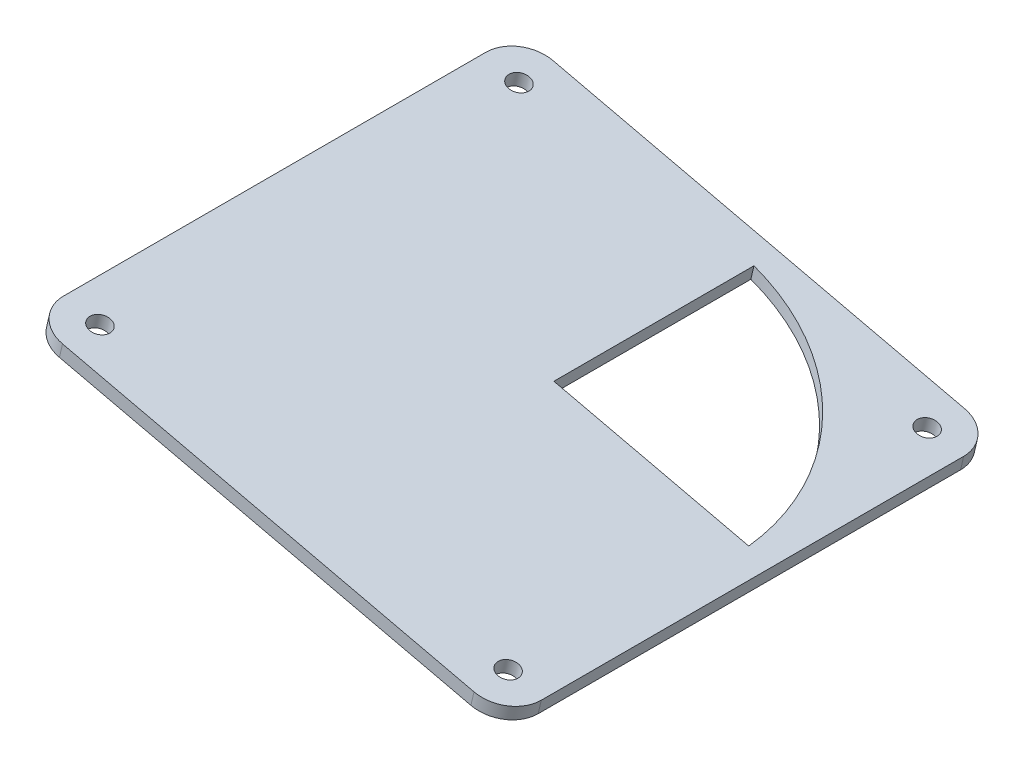
ISO-10303-21;
HEADER;
FILE_DESCRIPTION(('STEP AP214'),'2;1');
FILE_NAME('part.step','',(''),(''),'','','');
FILE_SCHEMA(('AUTOMOTIVE_DESIGN { 1 0 10303 214 1 1 1 1 }'));
ENDSEC;
DATA;
#1=APPLICATION_CONTEXT('core data for automotive mechanical design processes');
#2=APPLICATION_PROTOCOL_DEFINITION('international standard','automotive_design',2000,#1);
#3=PRODUCT_CONTEXT('',#1,'mechanical');
#4=PRODUCT('Part','Part','',(#3));
#5=PRODUCT_RELATED_PRODUCT_CATEGORY('part','',(#4));
#6=PRODUCT_DEFINITION_FORMATION('','',#4);
#7=PRODUCT_DEFINITION_CONTEXT('part definition',#1,'design');
#8=PRODUCT_DEFINITION('design','',#6,#7);
#9=PRODUCT_DEFINITION_SHAPE('','',#8);
#10=(LENGTH_UNIT() NAMED_UNIT(*) SI_UNIT(.MILLI.,.METRE.));
#11=(NAMED_UNIT(*) PLANE_ANGLE_UNIT() SI_UNIT($,.RADIAN.));
#12=(NAMED_UNIT(*) SI_UNIT($,.STERADIAN.) SOLID_ANGLE_UNIT());
#13=UNCERTAINTY_MEASURE_WITH_UNIT(LENGTH_MEASURE(1.E-05),#10,'distance_accuracy_value','');
#14=(GEOMETRIC_REPRESENTATION_CONTEXT(3) GLOBAL_UNCERTAINTY_ASSIGNED_CONTEXT((#13)) GLOBAL_UNIT_ASSIGNED_CONTEXT((#10,
#11,#12)) REPRESENTATION_CONTEXT('',''));
#15=CARTESIAN_POINT('',(0.,0.,0.));
#16=DIRECTION('',(0.,0.,1.));
#17=DIRECTION('',(1.,0.,0.));
#18=AXIS2_PLACEMENT_3D('',#15,#16,#17);
#19=CARTESIAN_POINT('',(-50.3621157465799,72.3277479247575,65.2764415124017));
#20=DIRECTION('',(-0.226273724263932,-0.974063756490164,0.));
#21=DIRECTION('',(0.974063756490165,-0.226273724263932,0.));
#22=AXIS2_PLACEMENT_3D('',#19,#20,#21);
#23=PLANE('',#22);
#24=CARTESIAN_POINT('',(-50.3621157465799,72.3277479247575,65.2764415124017));
#25=DIRECTION('',(0.226273724263932,0.974063756490164,0.));
#26=DIRECTION('',(0.974063756490165,-0.226273724263932,0.));
#27=AXIS2_PLACEMENT_3D('',#24,#25,#26);
#28=CIRCLE('',#27,5.);
#29=CARTESIAN_POINT('',(-55.2324345290308,73.4591165460771,65.2764415124017));
#30=VERTEX_POINT('',#29);
#31=CARTESIAN_POINT('',(-50.3621157465799,72.3277479247575,70.2764415124017));
#32=VERTEX_POINT('',#31);
#33=EDGE_CURVE('E170',#30,#32,#28,.T.);
#34=ORIENTED_EDGE('',*,*,#33,.T.);
#35=DIRECTION('',(0.974063756490164,-0.226273724263932,0.));
#36=VECTOR('',#35,1.);
#37=CARTESIAN_POINT('',(-50.3621157465799,72.3277479247575,70.2764415124017));
#38=LINE('',#37,#36);
#39=CARTESIAN_POINT('',(10.0298371558103,58.2987770203937,70.2764415124017));
#40=VERTEX_POINT('',#39);
#41=EDGE_CURVE('E173',#32,#40,#38,.T.);
#42=ORIENTED_EDGE('',*,*,#41,.T.);
#43=CARTESIAN_POINT('',(10.0298371558103,58.2987770203937,65.2764415124017));
#44=DIRECTION('',(0.226273724263932,0.974063756490164,0.));
#45=DIRECTION('',(-0.974063756490165,0.226273724263932,0.));
#46=AXIS2_PLACEMENT_3D('',#43,#44,#45);
#47=CIRCLE('',#46,5.);
#48=CARTESIAN_POINT('',(14.9001559382611,57.167408399074,65.2764415124017));
#49=VERTEX_POINT('',#48);
#50=EDGE_CURVE('E176',#40,#49,#47,.T.);
#51=ORIENTED_EDGE('',*,*,#50,.T.);
#52=DIRECTION('',(0.,0.,-1.));
#53=VECTOR('',#52,1.);
#54=CARTESIAN_POINT('',(14.9001559382611,57.167408399074,65.2764415124017));
#55=LINE('',#54,#53);
#56=CARTESIAN_POINT('',(14.9001559382611,57.167408399074,3.27644151240175));
#57=VERTEX_POINT('',#56);
#58=EDGE_CURVE('E178',#49,#57,#55,.T.);
#59=ORIENTED_EDGE('',*,*,#58,.T.);
#60=CARTESIAN_POINT('',(10.0298371558103,58.2987770203937,3.27644151240175));
#61=DIRECTION('',(0.226273724263932,0.974063756490164,0.));
#62=DIRECTION('',(0.974063756490165,-0.226273724263932,0.));
#63=AXIS2_PLACEMENT_3D('',#60,#61,#62);
#64=CIRCLE('',#63,5.);
#65=CARTESIAN_POINT('',(10.0298371558103,58.2987770203937,-1.72355848759825));
#66=VERTEX_POINT('',#65);
#67=EDGE_CURVE('E180',#57,#66,#64,.T.);
#68=ORIENTED_EDGE('',*,*,#67,.T.);
#69=DIRECTION('',(-0.974063756490164,0.226273724263932,0.));
#70=VECTOR('',#69,1.);
#71=CARTESIAN_POINT('',(-50.3621157465799,72.3277479247575,-1.72355848759825));
#72=LINE('',#71,#70);
#73=CARTESIAN_POINT('',(-50.3621157465799,72.3277479247575,-1.72355848759825));
#74=VERTEX_POINT('',#73);
#75=EDGE_CURVE('E182',#66,#74,#72,.T.);
#76=ORIENTED_EDGE('',*,*,#75,.T.);
#77=CARTESIAN_POINT('',(-50.3621157465799,72.3277479247575,3.27644151240175));
#78=DIRECTION('',(0.226273724263932,0.974063756490164,0.));
#79=DIRECTION('',(0.974063756490165,-0.226273724263932,0.));
#80=AXIS2_PLACEMENT_3D('',#77,#78,#79);
#81=CIRCLE('',#80,5.);
#82=CARTESIAN_POINT('',(-55.2324345290308,73.4591165460771,3.27644151240175));
#83=VERTEX_POINT('',#82);
#84=EDGE_CURVE('E184',#74,#83,#81,.T.);
#85=ORIENTED_EDGE('',*,*,#84,.T.);
#86=DIRECTION('',(0.,0.,1.));
#87=VECTOR('',#86,1.);
#88=CARTESIAN_POINT('',(-55.2324345290308,73.4591165460771,65.2764415124017));
#89=LINE('',#88,#87);
#90=EDGE_CURVE('E186',#83,#30,#89,.T.);
#91=ORIENTED_EDGE('',*,*,#90,.T.);
#92=EDGE_LOOP('',(#34,#42,#51,#59,#68,#76,#85,#91));
#93=FACE_BOUND('',#92,.T.);
#94=CARTESIAN_POINT('',(-50.1185998074574,72.2711794936915,3.52644151240175));
#95=DIRECTION('',(0.226273724263932,0.974063756490164,0.));
#96=DIRECTION('',(-0.974063756490165,0.226273724263932,0.));
#97=AXIS2_PLACEMENT_3D('',#94,#95,#96);
#98=CIRCLE('',#97,1.5);
#99=CARTESIAN_POINT('',(-51.5796954421927,72.6105900800874,3.52644151240175));
#100=VERTEX_POINT('',#99);
#101=EDGE_CURVE('E164',#100,#100,#98,.T.);
#102=ORIENTED_EDGE('',*,*,#101,.F.);
#103=EDGE_LOOP('',(#102));
#104=FACE_BOUND('',#103,.T.);
#105=CARTESIAN_POINT('',(-50.1185998074574,72.2711794936915,65.0264415124017));
#106=DIRECTION('',(0.226273724263932,0.974063756490164,0.));
#107=DIRECTION('',(-0.974063756490165,0.226273724263932,0.));
#108=AXIS2_PLACEMENT_3D('',#105,#106,#107);
#109=CIRCLE('',#108,1.5);
#110=CARTESIAN_POINT('',(-51.5796954421927,72.6105900800874,65.0264415124017));
#111=VERTEX_POINT('',#110);
#112=EDGE_CURVE('E158',#111,#111,#109,.T.);
#113=ORIENTED_EDGE('',*,*,#112,.F.);
#114=EDGE_LOOP('',(#113));
#115=FACE_BOUND('',#114,.T.);
#116=CARTESIAN_POINT('',(9.78632121668771,58.3553454514597,65.0264415124017));
#117=DIRECTION('',(0.226273724263932,0.974063756490164,0.));
#118=DIRECTION('',(-0.974063756490165,0.226273724263932,0.));
#119=AXIS2_PLACEMENT_3D('',#116,#117,#118);
#120=CIRCLE('',#119,1.5);
#121=CARTESIAN_POINT('',(8.32522558195246,58.6947560378556,65.0264415124017));
#122=VERTEX_POINT('',#121);
#123=EDGE_CURVE('E152',#122,#122,#120,.T.);
#124=ORIENTED_EDGE('',*,*,#123,.F.);
#125=EDGE_LOOP('',(#124));
#126=FACE_BOUND('',#125,.T.);
#127=CARTESIAN_POINT('',(9.78632121668769,58.3553454514597,3.52644151240175));
#128=DIRECTION('',(0.226273724263932,0.974063756490164,0.));
#129=DIRECTION('',(-0.974063756490165,0.226273724263932,0.));
#130=AXIS2_PLACEMENT_3D('',#127,#128,#129);
#131=CIRCLE('',#130,1.5);
#132=CARTESIAN_POINT('',(8.32522558195245,58.6947560378556,3.52644151240175));
#133=VERTEX_POINT('',#132);
#134=EDGE_CURVE('E146',#133,#133,#131,.T.);
#135=ORIENTED_EDGE('',*,*,#134,.F.);
#136=EDGE_LOOP('',(#135));
#137=FACE_BOUND('',#136,.T.);
#138=CARTESIAN_POINT('',(-20.1661392953848,65.3132624725756,34.2764415124018));
#139=DIRECTION('',(0.226273724263932,0.974063756490164,0.));
#140=DIRECTION('',(-0.974063756490165,0.226273724263932,0.));
#141=AXIS2_PLACEMENT_3D('',#138,#139,#140);
#142=CIRCLE('',#141,32.5);
#143=CARTESIAN_POINT('',(11.3557738958925,57.9907636667321,31.2764415124017));
#144=VERTEX_POINT('',#143);
#145=CARTESIAN_POINT('',(-17.2439480259143,64.6344412997838,1.91519926183294));
#146=VERTEX_POINT('',#145);
#147=EDGE_CURVE('E142',#144,#146,#142,.T.);
#148=ORIENTED_EDGE('',*,*,#147,.F.);
#149=DIRECTION('',(0.974063756490164,-0.226273724263932,0.));
#150=VECTOR('',#149,1.);
#151=CARTESIAN_POINT('',(13.3628695619654,57.5245179941154,31.2764415124017));
#152=LINE('',#151,#150);
#153=CARTESIAN_POINT('',(-17.2439480259143,64.6344412997838,31.2764415124017));
#154=VERTEX_POINT('',#153);
#155=EDGE_CURVE('E138',#154,#144,#152,.T.);
#156=ORIENTED_EDGE('',*,*,#155,.F.);
#157=DIRECTION('',(0.,0.,-1.));
#158=VECTOR('',#157,1.);
#159=CARTESIAN_POINT('',(-17.2439480259143,64.6344412997838,0.));
#160=LINE('',#159,#158);
#161=EDGE_CURVE('E123',#154,#146,#160,.T.);
#162=ORIENTED_EDGE('',*,*,#161,.T.);
#163=EDGE_LOOP('',(#148,#156,#162));
#164=FACE_BOUND('',#163,.T.);
#165=ADVANCED_FACE('F35',(#93,#104,#115,#126,#137,#164),#23,.F.);
#166=CARTESIAN_POINT('',(-50.8146631951078,70.3796204117771,65.2764415124017));
#167=DIRECTION('',(-0.226273724263932,-0.974063756490164,0.));
#168=DIRECTION('',(0.974063756490165,-0.226273724263932,0.));
#169=AXIS2_PLACEMENT_3D('',#166,#167,#168);
#170=PLANE('',#169);
#171=CARTESIAN_POINT('',(9.33377376815983,56.4072179384793,3.52644151240175));
#172=DIRECTION('',(0.226273724263932,0.974063756490164,0.));
#173=DIRECTION('',(-0.974063756490165,0.226273724263932,0.));
#174=AXIS2_PLACEMENT_3D('',#171,#172,#173);
#175=CIRCLE('',#174,1.5);
#176=CARTESIAN_POINT('',(7.87267813342458,56.7466285248752,3.52644151240175));
#177=VERTEX_POINT('',#176);
#178=EDGE_CURVE('E144',#177,#177,#175,.T.);
#179=ORIENTED_EDGE('',*,*,#178,.T.);
#180=EDGE_LOOP('',(#179));
#181=FACE_BOUND('',#180,.T.);
#182=CARTESIAN_POINT('',(-50.5711472559853,70.3230519807111,65.0264415124017));
#183=DIRECTION('',(0.226273724263932,0.974063756490164,0.));
#184=DIRECTION('',(-0.974063756490165,0.226273724263932,0.));
#185=AXIS2_PLACEMENT_3D('',#182,#183,#184);
#186=CIRCLE('',#185,1.5);
#187=CARTESIAN_POINT('',(-52.0322428907205,70.6624625671071,65.0264415124017));
#188=VERTEX_POINT('',#187);
#189=EDGE_CURVE('E155',#188,#188,#186,.T.);
#190=ORIENTED_EDGE('',*,*,#189,.T.);
#191=EDGE_LOOP('',(#190));
#192=FACE_BOUND('',#191,.T.);
#193=CARTESIAN_POINT('',(-50.8146631951078,70.3796204117771,65.2764415124017));
#194=DIRECTION('',(0.226273724263932,0.974063756490164,0.));
#195=DIRECTION('',(0.974063756490165,-0.226273724263932,0.));
#196=AXIS2_PLACEMENT_3D('',#193,#194,#195);
#197=CIRCLE('',#196,5.);
#198=CARTESIAN_POINT('',(-55.6849819775586,71.5109890330968,65.2764415124017));
#199=VERTEX_POINT('',#198);
#200=CARTESIAN_POINT('',(-50.8146631951078,70.3796204117771,70.2764415124017));
#201=VERTEX_POINT('',#200);
#202=EDGE_CURVE('E167',#199,#201,#197,.T.);
#203=ORIENTED_EDGE('',*,*,#202,.F.);
#204=DIRECTION('',(0.,0.,1.));
#205=VECTOR('',#204,1.);
#206=CARTESIAN_POINT('',(-55.6849819775586,71.5109890330968,65.2764415124017));
#207=LINE('',#206,#205);
#208=CARTESIAN_POINT('',(-55.6849819775586,71.5109890330968,3.27644151240175));
#209=VERTEX_POINT('',#208);
#210=EDGE_CURVE('E174',#209,#199,#207,.T.);
#211=ORIENTED_EDGE('',*,*,#210,.F.);
#212=CARTESIAN_POINT('',(-50.8146631951078,70.3796204117771,3.27644151240175));
#213=DIRECTION('',(0.226273724263932,0.974063756490164,0.));
#214=DIRECTION('',(0.974063756490165,-0.226273724263932,0.));
#215=AXIS2_PLACEMENT_3D('',#212,#213,#214);
#216=CIRCLE('',#215,5.);
#217=CARTESIAN_POINT('',(-50.8146631951078,70.3796204117771,-1.72355848759825));
#218=VERTEX_POINT('',#217);
#219=EDGE_CURVE('E201',#218,#209,#216,.T.);
#220=ORIENTED_EDGE('',*,*,#219,.F.);
#221=DIRECTION('',(-0.974063756490164,0.226273724263932,0.));
#222=VECTOR('',#221,1.);
#223=CARTESIAN_POINT('',(-50.8146631951078,70.3796204117771,-1.72355848759825));
#224=LINE('',#223,#222);
#225=CARTESIAN_POINT('',(9.57728970728239,56.3506495074134,-1.72355848759825));
#226=VERTEX_POINT('',#225);
#227=EDGE_CURVE('E199',#226,#218,#224,.T.);
#228=ORIENTED_EDGE('',*,*,#227,.F.);
#229=CARTESIAN_POINT('',(9.57728970728239,56.3506495074134,3.27644151240175));
#230=DIRECTION('',(0.226273724263932,0.974063756490164,0.));
#231=DIRECTION('',(0.974063756490165,-0.226273724263932,0.));
#232=AXIS2_PLACEMENT_3D('',#229,#230,#231);
#233=CIRCLE('',#232,5.);
#234=CARTESIAN_POINT('',(14.4476084897332,55.2192808860937,3.27644151240175));
#235=VERTEX_POINT('',#234);
#236=EDGE_CURVE('E197',#235,#226,#233,.T.);
#237=ORIENTED_EDGE('',*,*,#236,.F.);
#238=DIRECTION('',(0.,0.,-1.));
#239=VECTOR('',#238,1.);
#240=CARTESIAN_POINT('',(14.4476084897332,55.2192808860937,65.2764415124017));
#241=LINE('',#240,#239);
#242=CARTESIAN_POINT('',(14.4476084897332,55.2192808860937,65.2764415124017));
#243=VERTEX_POINT('',#242);
#244=EDGE_CURVE('E195',#243,#235,#241,.T.);
#245=ORIENTED_EDGE('',*,*,#244,.F.);
#246=CARTESIAN_POINT('',(9.57728970728239,56.3506495074134,65.2764415124017));
#247=DIRECTION('',(0.226273724263932,0.974063756490164,0.));
#248=DIRECTION('',(-0.974063756490165,0.226273724263932,0.));
#249=AXIS2_PLACEMENT_3D('',#246,#247,#248);
#250=CIRCLE('',#249,5.);
#251=CARTESIAN_POINT('',(9.57728970728239,56.3506495074134,70.2764415124017));
#252=VERTEX_POINT('',#251);
#253=EDGE_CURVE('E193',#252,#243,#250,.T.);
#254=ORIENTED_EDGE('',*,*,#253,.F.);
#255=DIRECTION('',(0.974063756490164,-0.226273724263932,0.));
#256=VECTOR('',#255,1.);
#257=CARTESIAN_POINT('',(-50.8146631951078,70.3796204117771,70.2764415124017));
#258=LINE('',#257,#256);
#259=EDGE_CURVE('E191',#201,#252,#258,.T.);
#260=ORIENTED_EDGE('',*,*,#259,.F.);
#261=EDGE_LOOP('',(#203,#211,#220,#228,#237,#245,#254,#260));
#262=FACE_BOUND('',#261,.T.);
#263=CARTESIAN_POINT('',(-50.5711472559853,70.3230519807111,3.52644151240175));
#264=DIRECTION('',(0.226273724263932,0.974063756490164,0.));
#265=DIRECTION('',(-0.974063756490165,0.226273724263932,0.));
#266=AXIS2_PLACEMENT_3D('',#263,#264,#265);
#267=CIRCLE('',#266,1.5);
#268=CARTESIAN_POINT('',(-52.0322428907205,70.6624625671071,3.52644151240175));
#269=VERTEX_POINT('',#268);
#270=EDGE_CURVE('E161',#269,#269,#267,.T.);
#271=ORIENTED_EDGE('',*,*,#270,.T.);
#272=EDGE_LOOP('',(#271));
#273=FACE_BOUND('',#272,.T.);
#274=CARTESIAN_POINT('',(9.33377376815984,56.4072179384793,65.0264415124017));
#275=DIRECTION('',(0.226273724263932,0.974063756490164,0.));
#276=DIRECTION('',(-0.974063756490165,0.226273724263932,0.));
#277=AXIS2_PLACEMENT_3D('',#274,#275,#276);
#278=CIRCLE('',#277,1.5);
#279=CARTESIAN_POINT('',(7.8726781334246,56.7466285248752,65.0264415124017));
#280=VERTEX_POINT('',#279);
#281=EDGE_CURVE('E149',#280,#280,#278,.T.);
#282=ORIENTED_EDGE('',*,*,#281,.T.);
#283=EDGE_LOOP('',(#282));
#284=FACE_BOUND('',#283,.T.);
#285=CARTESIAN_POINT('',(-20.6186867439127,63.3651349595952,34.2764415124018));
#286=DIRECTION('',(0.226273724263932,0.974063756490164,0.));
#287=DIRECTION('',(-0.974063756490165,0.226273724263932,0.));
#288=AXIS2_PLACEMENT_3D('',#285,#286,#287);
#289=CIRCLE('',#288,32.5);
#290=CARTESIAN_POINT('',(10.9032264473646,56.0426361537517,31.2764415124017));
#291=VERTEX_POINT('',#290);
#292=CARTESIAN_POINT('',(-17.6964954744422,62.6863137868034,1.91519926183294));
#293=VERTEX_POINT('',#292);
#294=EDGE_CURVE('E54',#291,#293,#289,.T.);
#295=ORIENTED_EDGE('',*,*,#294,.T.);
#296=DIRECTION('',(0.,0.,-1.));
#297=VECTOR('',#296,1.);
#298=CARTESIAN_POINT('',(-17.6964954744422,62.6863137868035,0.));
#299=LINE('',#298,#297);
#300=CARTESIAN_POINT('',(-17.6964954744422,62.6863137868035,31.2764415124017));
#301=VERTEX_POINT('',#300);
#302=EDGE_CURVE('E121',#301,#293,#299,.T.);
#303=ORIENTED_EDGE('',*,*,#302,.F.);
#304=DIRECTION('',(0.974063756490164,-0.226273724263932,0.));
#305=VECTOR('',#304,1.);
#306=CARTESIAN_POINT('',(12.9103221134375,55.5763904811351,31.2764415124017));
#307=LINE('',#306,#305);
#308=EDGE_CURVE('E130',#301,#291,#307,.T.);
#309=ORIENTED_EDGE('',*,*,#308,.T.);
#310=EDGE_LOOP('',(#295,#303,#309));
#311=FACE_BOUND('',#310,.T.);
#312=ADVANCED_FACE('F134',(#181,#192,#262,#273,#284,#311),#170,.T.);
#313=CARTESIAN_POINT('',(-50.3621157465799,72.3277479247575,65.2764415124017));
#314=DIRECTION('',(-0.226273724263932,-0.974063756490164,0.));
#315=DIRECTION('',(0.974063756490165,-0.226273724263932,0.));
#316=AXIS2_PLACEMENT_3D('',#313,#314,#315);
#317=CYLINDRICAL_SURFACE('',#316,5.);
#318=ORIENTED_EDGE('',*,*,#202,.T.);
#319=DIRECTION('',(-0.226273724263932,-0.974063756490164,0.));
#320=VECTOR('',#319,1.);
#321=CARTESIAN_POINT('',(-50.3621157465799,72.3277479247575,70.2764415124017));
#322=LINE('',#321,#320);
#323=EDGE_CURVE('E11',#32,#201,#322,.T.);
#324=ORIENTED_EDGE('',*,*,#323,.F.);
#325=ORIENTED_EDGE('',*,*,#33,.F.);
#326=DIRECTION('',(-0.226273724263932,-0.974063756490164,0.));
#327=VECTOR('',#326,1.);
#328=CARTESIAN_POINT('',(-55.2324345290308,73.4591165460771,65.2764415124017));
#329=LINE('',#328,#327);
#330=EDGE_CURVE('E188',#30,#199,#329,.T.);
#331=ORIENTED_EDGE('',*,*,#330,.T.);
#332=EDGE_LOOP('',(#318,#324,#325,#331));
#333=FACE_BOUND('',#332,.T.);
#334=ADVANCED_FACE('F37',(#333),#317,.T.);
#335=CARTESIAN_POINT('',(-50.3621157465799,72.3277479247575,70.2764415124017));
#336=DIRECTION('',(0.,0.,-1.));
#337=DIRECTION('',(-1.,0.,0.));
#338=AXIS2_PLACEMENT_3D('',#335,#336,#337);
#339=PLANE('',#338);
#340=ORIENTED_EDGE('',*,*,#259,.T.);
#341=DIRECTION('',(-0.226273724263932,-0.974063756490164,0.));
#342=VECTOR('',#341,1.);
#343=CARTESIAN_POINT('',(10.0298371558103,58.2987770203937,70.2764415124017));
#344=LINE('',#343,#342);
#345=EDGE_CURVE('E43',#40,#252,#344,.T.);
#346=ORIENTED_EDGE('',*,*,#345,.F.);
#347=ORIENTED_EDGE('',*,*,#41,.F.);
#348=ORIENTED_EDGE('',*,*,#323,.T.);
#349=EDGE_LOOP('',(#340,#346,#347,#348));
#350=FACE_BOUND('',#349,.T.);
#351=ADVANCED_FACE('F248',(#350),#339,.F.);
#352=CARTESIAN_POINT('',(10.0298371558103,58.2987770203937,65.2764415124017));
#353=DIRECTION('',(-0.226273724263932,-0.974063756490164,0.));
#354=DIRECTION('',(0.974063756490165,-0.226273724263932,0.));
#355=AXIS2_PLACEMENT_3D('',#352,#353,#354);
#356=CYLINDRICAL_SURFACE('',#355,5.);
#357=ORIENTED_EDGE('',*,*,#253,.T.);
#358=DIRECTION('',(-0.226273724263932,-0.974063756490164,0.));
#359=VECTOR('',#358,1.);
#360=CARTESIAN_POINT('',(14.9001559382611,57.167408399074,65.2764415124017));
#361=LINE('',#360,#359);
#362=EDGE_CURVE('E218',#49,#243,#361,.T.);
#363=ORIENTED_EDGE('',*,*,#362,.F.);
#364=ORIENTED_EDGE('',*,*,#50,.F.);
#365=ORIENTED_EDGE('',*,*,#345,.T.);
#366=EDGE_LOOP('',(#357,#363,#364,#365));
#367=FACE_BOUND('',#366,.T.);
#368=ADVANCED_FACE('F225',(#367),#356,.T.);
#369=CARTESIAN_POINT('',(14.9001559382611,57.167408399074,65.2764415124017));
#370=DIRECTION('',(-0.974063756490164,0.226273724263932,0.));
#371=DIRECTION('',(-0.226273724263932,-0.974063756490165,0.));
#372=AXIS2_PLACEMENT_3D('',#369,#370,#371);
#373=PLANE('',#372);
#374=ORIENTED_EDGE('',*,*,#244,.T.);
#375=DIRECTION('',(-0.226273724263932,-0.974063756490164,0.));
#376=VECTOR('',#375,1.);
#377=CARTESIAN_POINT('',(14.9001559382611,57.167408399074,3.27644151240175));
#378=LINE('',#377,#376);
#379=EDGE_CURVE('E215',#57,#235,#378,.T.);
#380=ORIENTED_EDGE('',*,*,#379,.F.);
#381=ORIENTED_EDGE('',*,*,#58,.F.);
#382=ORIENTED_EDGE('',*,*,#362,.T.);
#383=EDGE_LOOP('',(#374,#380,#381,#382));
#384=FACE_BOUND('',#383,.T.);
#385=ADVANCED_FACE('F236',(#384),#373,.F.);
#386=CARTESIAN_POINT('',(10.0298371558103,58.2987770203937,3.27644151240175));
#387=DIRECTION('',(-0.226273724263932,-0.974063756490164,0.));
#388=DIRECTION('',(0.974063756490165,-0.226273724263932,0.));
#389=AXIS2_PLACEMENT_3D('',#386,#387,#388);
#390=CYLINDRICAL_SURFACE('',#389,5.);
#391=ORIENTED_EDGE('',*,*,#236,.T.);
#392=DIRECTION('',(-0.226273724263932,-0.974063756490164,0.));
#393=VECTOR('',#392,1.);
#394=CARTESIAN_POINT('',(10.0298371558103,58.2987770203937,-1.72355848759825));
#395=LINE('',#394,#393);
#396=EDGE_CURVE('E212',#66,#226,#395,.T.);
#397=ORIENTED_EDGE('',*,*,#396,.F.);
#398=ORIENTED_EDGE('',*,*,#67,.F.);
#399=ORIENTED_EDGE('',*,*,#379,.T.);
#400=EDGE_LOOP('',(#391,#397,#398,#399));
#401=FACE_BOUND('',#400,.T.);
#402=ADVANCED_FACE('F240',(#401),#390,.T.);
#403=CARTESIAN_POINT('',(-50.3621157465799,72.3277479247575,-1.72355848759825));
#404=DIRECTION('',(0.,0.,1.));
#405=DIRECTION('',(1.,0.,0.));
#406=AXIS2_PLACEMENT_3D('',#403,#404,#405);
#407=PLANE('',#406);
#408=ORIENTED_EDGE('',*,*,#227,.T.);
#409=DIRECTION('',(-0.226273724263932,-0.974063756490164,0.));
#410=VECTOR('',#409,1.);
#411=CARTESIAN_POINT('',(-50.3621157465799,72.3277479247575,-1.72355848759825));
#412=LINE('',#411,#410);
#413=EDGE_CURVE('E209',#74,#218,#412,.T.);
#414=ORIENTED_EDGE('',*,*,#413,.F.);
#415=ORIENTED_EDGE('',*,*,#75,.F.);
#416=ORIENTED_EDGE('',*,*,#396,.T.);
#417=EDGE_LOOP('',(#408,#414,#415,#416));
#418=FACE_BOUND('',#417,.T.);
#419=ADVANCED_FACE('F261',(#418),#407,.F.);
#420=CARTESIAN_POINT('',(-50.3621157465799,72.3277479247575,3.27644151240175));
#421=DIRECTION('',(-0.226273724263932,-0.974063756490164,0.));
#422=DIRECTION('',(0.974063756490165,-0.226273724263932,0.));
#423=AXIS2_PLACEMENT_3D('',#420,#421,#422);
#424=CYLINDRICAL_SURFACE('',#423,5.);
#425=ORIENTED_EDGE('',*,*,#219,.T.);
#426=DIRECTION('',(-0.226273724263932,-0.974063756490164,0.));
#427=VECTOR('',#426,1.);
#428=CARTESIAN_POINT('',(-55.2324345290308,73.4591165460771,3.27644151240175));
#429=LINE('',#428,#427);
#430=EDGE_CURVE('E206',#83,#209,#429,.T.);
#431=ORIENTED_EDGE('',*,*,#430,.F.);
#432=ORIENTED_EDGE('',*,*,#84,.F.);
#433=ORIENTED_EDGE('',*,*,#413,.T.);
#434=EDGE_LOOP('',(#425,#431,#432,#433));
#435=FACE_BOUND('',#434,.T.);
#436=ADVANCED_FACE('F259',(#435),#424,.T.);
#437=CARTESIAN_POINT('',(-55.2324345290308,73.4591165460771,65.2764415124017));
#438=DIRECTION('',(0.974063756490164,-0.226273724263932,0.));
#439=DIRECTION('',(0.226273724263932,0.974063756490165,0.));
#440=AXIS2_PLACEMENT_3D('',#437,#438,#439);
#441=PLANE('',#440);
#442=ORIENTED_EDGE('',*,*,#210,.T.);
#443=ORIENTED_EDGE('',*,*,#330,.F.);
#444=ORIENTED_EDGE('',*,*,#90,.F.);
#445=ORIENTED_EDGE('',*,*,#430,.T.);
#446=EDGE_LOOP('',(#442,#443,#444,#445));
#447=FACE_BOUND('',#446,.T.);
#448=ADVANCED_FACE('F254',(#447),#441,.F.);
#449=CARTESIAN_POINT('',(-50.1185998074574,72.2711794936915,3.52644151240175));
#450=DIRECTION('',(-0.226273724263932,-0.974063756490164,0.));
#451=DIRECTION('',(0.974063756490165,-0.226273724263932,0.));
#452=AXIS2_PLACEMENT_3D('',#449,#450,#451);
#453=CYLINDRICAL_SURFACE('',#452,1.5);
#454=ORIENTED_EDGE('',*,*,#101,.T.);
#455=EDGE_LOOP('',(#454));
#456=FACE_BOUND('',#455,.T.);
#457=ORIENTED_EDGE('',*,*,#270,.F.);
#458=EDGE_LOOP('',(#457));
#459=FACE_BOUND('',#458,.T.);
#460=ADVANCED_FACE('F278',(#456,#459),#453,.F.);
#461=CARTESIAN_POINT('',(-50.1185998074574,72.2711794936915,65.0264415124017));
#462=DIRECTION('',(-0.226273724263932,-0.974063756490164,0.));
#463=DIRECTION('',(0.974063756490165,-0.226273724263932,0.));
#464=AXIS2_PLACEMENT_3D('',#461,#462,#463);
#465=CYLINDRICAL_SURFACE('',#464,1.5);
#466=ORIENTED_EDGE('',*,*,#112,.T.);
#467=EDGE_LOOP('',(#466));
#468=FACE_BOUND('',#467,.T.);
#469=ORIENTED_EDGE('',*,*,#189,.F.);
#470=EDGE_LOOP('',(#469));
#471=FACE_BOUND('',#470,.T.);
#472=ADVANCED_FACE('F285',(#468,#471),#465,.F.);
#473=CARTESIAN_POINT('',(9.78632121668771,58.3553454514597,65.0264415124017));
#474=DIRECTION('',(-0.226273724263932,-0.974063756490164,0.));
#475=DIRECTION('',(0.974063756490165,-0.226273724263932,0.));
#476=AXIS2_PLACEMENT_3D('',#473,#474,#475);
#477=CYLINDRICAL_SURFACE('',#476,1.5);
#478=ORIENTED_EDGE('',*,*,#123,.T.);
#479=EDGE_LOOP('',(#478));
#480=FACE_BOUND('',#479,.T.);
#481=ORIENTED_EDGE('',*,*,#281,.F.);
#482=EDGE_LOOP('',(#481));
#483=FACE_BOUND('',#482,.T.);
#484=ADVANCED_FACE('F290',(#480,#483),#477,.F.);
#485=CARTESIAN_POINT('',(9.78632121668769,58.3553454514597,3.52644151240175));
#486=DIRECTION('',(-0.226273724263932,-0.974063756490164,0.));
#487=DIRECTION('',(0.974063756490165,-0.226273724263932,0.));
#488=AXIS2_PLACEMENT_3D('',#485,#486,#487);
#489=CYLINDRICAL_SURFACE('',#488,1.5);
#490=ORIENTED_EDGE('',*,*,#134,.T.);
#491=EDGE_LOOP('',(#490));
#492=FACE_BOUND('',#491,.T.);
#493=ORIENTED_EDGE('',*,*,#178,.F.);
#494=EDGE_LOOP('',(#493));
#495=FACE_BOUND('',#494,.T.);
#496=ADVANCED_FACE('F299',(#492,#495),#489,.F.);
#497=CARTESIAN_POINT('',(-20.1661392953848,65.3132624725756,34.2764415124018));
#498=DIRECTION('',(-0.226273724263932,-0.974063756490164,0.));
#499=DIRECTION('',(0.974063756490165,-0.226273724263932,0.));
#500=AXIS2_PLACEMENT_3D('',#497,#498,#499);
#501=CYLINDRICAL_SURFACE('',#500,32.5);
#502=DIRECTION('',(0.226273724263932,0.974063756490164,0.));
#503=VECTOR('',#502,1.);
#504=CARTESIAN_POINT('',(-17.6964954744422,62.6863137868035,1.91519926183294));
#505=LINE('',#504,#503);
#506=EDGE_CURVE('E50',#293,#146,#505,.T.);
#507=ORIENTED_EDGE('',*,*,#506,.F.);
#508=ORIENTED_EDGE('',*,*,#294,.F.);
#509=DIRECTION('',(0.226273724263932,0.974063756490164,0.));
#510=VECTOR('',#509,1.);
#511=CARTESIAN_POINT('',(10.9032264473646,56.0426361537518,31.2764415124017));
#512=LINE('',#511,#510);
#513=EDGE_CURVE('E127',#291,#144,#512,.T.);
#514=ORIENTED_EDGE('',*,*,#513,.T.);
#515=ORIENTED_EDGE('',*,*,#147,.T.);
#516=EDGE_LOOP('',(#507,#508,#514,#515));
#517=FACE_BOUND('',#516,.T.);
#518=ADVANCED_FACE('F305',(#517),#501,.F.);
#519=CARTESIAN_POINT('',(-17.6964954744422,62.6863137868035,0.));
#520=DIRECTION('',(0.974063756490164,-0.226273724263932,0.));
#521=DIRECTION('',(0.226273724263932,0.974063756490165,0.));
#522=AXIS2_PLACEMENT_3D('',#519,#520,#521);
#523=PLANE('',#522);
#524=ORIENTED_EDGE('',*,*,#161,.F.);
#525=DIRECTION('',(0.226273724263932,0.974063756490164,0.));
#526=VECTOR('',#525,1.);
#527=CARTESIAN_POINT('',(-17.6964954744422,62.6863137868035,31.2764415124017));
#528=LINE('',#527,#526);
#529=EDGE_CURVE('E117',#301,#154,#528,.T.);
#530=ORIENTED_EDGE('',*,*,#529,.F.);
#531=ORIENTED_EDGE('',*,*,#302,.T.);
#532=ORIENTED_EDGE('',*,*,#506,.T.);
#533=EDGE_LOOP('',(#524,#530,#531,#532));
#534=FACE_BOUND('',#533,.T.);
#535=ADVANCED_FACE('F119',(#534),#523,.T.);
#536=CARTESIAN_POINT('',(12.9103221134375,55.5763904811351,31.2764415124017));
#537=DIRECTION('',(0.,0.,1.));
#538=DIRECTION('',(1.,0.,0.));
#539=AXIS2_PLACEMENT_3D('',#536,#537,#538);
#540=PLANE('',#539);
#541=ORIENTED_EDGE('',*,*,#155,.T.);
#542=ORIENTED_EDGE('',*,*,#513,.F.);
#543=ORIENTED_EDGE('',*,*,#308,.F.);
#544=ORIENTED_EDGE('',*,*,#529,.T.);
#545=EDGE_LOOP('',(#541,#542,#543,#544));
#546=FACE_BOUND('',#545,.T.);
#547=ADVANCED_FACE('F131',(#546),#540,.F.);
#548=CLOSED_SHELL('',(#165,#312,#334,#351,#368,#385,#402,#419,#436,#448,#460,#472,#484,#496,
#518,#535,#547));
#549=MANIFOLD_SOLID_BREP('B2',#548);
#550=ADVANCED_BREP_SHAPE_REPRESENTATION('',(#18,#549),#14);
#551=SHAPE_DEFINITION_REPRESENTATION(#9,#550);
ENDSEC;
END-ISO-10303-21;
